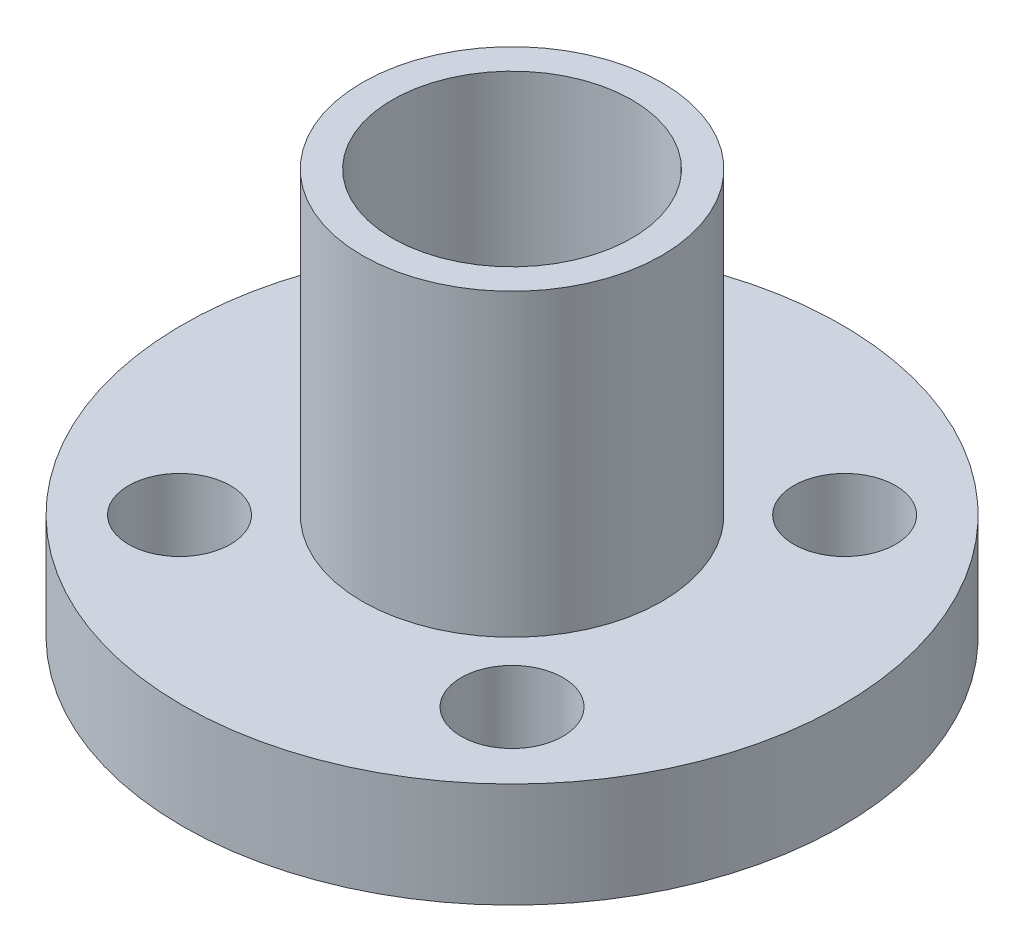
ISO-10303-21;
HEADER;
FILE_DESCRIPTION(('STEP AP214'),'2;1');
FILE_NAME('part.step','',(''),(''),'','','');
FILE_SCHEMA(('AUTOMOTIVE_DESIGN { 1 0 10303 214 1 1 1 1 }'));
ENDSEC;
DATA;
#1=APPLICATION_CONTEXT('core data for automotive mechanical design processes');
#2=APPLICATION_PROTOCOL_DEFINITION('international standard','automotive_design',2000,#1);
#3=PRODUCT_CONTEXT('',#1,'mechanical');
#4=PRODUCT('Part','Part','',(#3));
#5=PRODUCT_RELATED_PRODUCT_CATEGORY('part','',(#4));
#6=PRODUCT_DEFINITION_FORMATION('','',#4);
#7=PRODUCT_DEFINITION_CONTEXT('part definition',#1,'design');
#8=PRODUCT_DEFINITION('design','',#6,#7);
#9=PRODUCT_DEFINITION_SHAPE('','',#8);
#10=(LENGTH_UNIT() NAMED_UNIT(*) SI_UNIT(.MILLI.,.METRE.));
#11=(NAMED_UNIT(*) PLANE_ANGLE_UNIT() SI_UNIT($,.RADIAN.));
#12=(NAMED_UNIT(*) SI_UNIT($,.STERADIAN.) SOLID_ANGLE_UNIT());
#13=UNCERTAINTY_MEASURE_WITH_UNIT(LENGTH_MEASURE(1.E-05),#10,'distance_accuracy_value','');
#14=(GEOMETRIC_REPRESENTATION_CONTEXT(3) GLOBAL_UNCERTAINTY_ASSIGNED_CONTEXT((#13)) GLOBAL_UNIT_ASSIGNED_CONTEXT((#10,
#11,#12)) REPRESENTATION_CONTEXT('',''));
#15=CARTESIAN_POINT('',(0.,0.,0.));
#16=DIRECTION('',(0.,0.,1.));
#17=DIRECTION('',(1.,0.,0.));
#18=AXIS2_PLACEMENT_3D('',#15,#16,#17);
#19=CARTESIAN_POINT('',(-13.8327545983952,3.5,13.4034603001294));
#20=DIRECTION('',(0.,1.,0.));
#21=DIRECTION('',(0.,0.,1.));
#22=AXIS2_PLACEMENT_3D('',#19,#20,#21);
#23=PLANE('',#22);
#24=CARTESIAN_POINT('',(-13.8327545983952,3.5,13.4034603001294));
#25=DIRECTION('',(0.,1.,0.));
#26=DIRECTION('',(0.,0.,1.));
#27=AXIS2_PLACEMENT_3D('',#24,#25,#26);
#28=CIRCLE('',#27,5.);
#29=CARTESIAN_POINT('',(-13.8327545983952,3.5,18.4034603001294));
#30=VERTEX_POINT('',#29);
#31=EDGE_CURVE('E61',#30,#30,#28,.T.);
#32=ORIENTED_EDGE('',*,*,#31,.F.);
#33=EDGE_LOOP('',(#32));
#34=FACE_BOUND('',#33,.T.);
#35=CARTESIAN_POINT('',(-19.3827545983952,3.5,18.9534603001294));
#36=DIRECTION('',(0.,1.,0.));
#37=DIRECTION('',(0.,0.,-1.));
#38=AXIS2_PLACEMENT_3D('',#35,#36,#37);
#39=CIRCLE('',#38,1.70000000000001);
#40=CARTESIAN_POINT('',(-19.3827545983952,3.5,17.2534603001294));
#41=VERTEX_POINT('',#40);
#42=EDGE_CURVE('E79',#41,#41,#39,.T.);
#43=ORIENTED_EDGE('',*,*,#42,.F.);
#44=EDGE_LOOP('',(#43));
#45=FACE_BOUND('',#44,.T.);
#46=CARTESIAN_POINT('',(-8.28275459839524,3.5,7.85346030012943));
#47=DIRECTION('',(0.,1.,0.));
#48=DIRECTION('',(0.,0.,-1.));
#49=AXIS2_PLACEMENT_3D('',#46,#47,#48);
#50=CIRCLE('',#49,1.70000000000001);
#51=CARTESIAN_POINT('',(-8.28275459839524,3.5,6.15346030012942));
#52=VERTEX_POINT('',#51);
#53=EDGE_CURVE('E91',#52,#52,#50,.T.);
#54=ORIENTED_EDGE('',*,*,#53,.F.);
#55=EDGE_LOOP('',(#54));
#56=FACE_BOUND('',#55,.T.);
#57=CARTESIAN_POINT('',(-13.8327545983952,3.5,13.4034603001294));
#58=DIRECTION('',(0.,1.,0.));
#59=DIRECTION('',(0.,0.,1.));
#60=AXIS2_PLACEMENT_3D('',#57,#58,#59);
#61=CIRCLE('',#60,11.);
#62=CARTESIAN_POINT('',(-13.8327545983952,3.5,24.4034603001294));
#63=VERTEX_POINT('',#62);
#64=EDGE_CURVE('E10',#63,#63,#61,.T.);
#65=ORIENTED_EDGE('',*,*,#64,.T.);
#66=EDGE_LOOP('',(#65));
#67=FACE_BOUND('',#66,.T.);
#68=CARTESIAN_POINT('',(-19.3827545983952,3.5,7.85346030012943));
#69=DIRECTION('',(0.,1.,0.));
#70=DIRECTION('',(0.,0.,1.));
#71=AXIS2_PLACEMENT_3D('',#68,#69,#70);
#72=CIRCLE('',#71,1.70000000000001);
#73=CARTESIAN_POINT('',(-19.3827545983952,3.5,9.55346030012944));
#74=VERTEX_POINT('',#73);
#75=EDGE_CURVE('E54',#74,#74,#72,.T.);
#76=ORIENTED_EDGE('',*,*,#75,.F.);
#77=EDGE_LOOP('',(#76));
#78=FACE_BOUND('',#77,.T.);
#79=CARTESIAN_POINT('',(-8.28275459839524,3.5,18.9534603001294));
#80=DIRECTION('',(0.,1.,0.));
#81=DIRECTION('',(0.,0.,1.));
#82=AXIS2_PLACEMENT_3D('',#79,#80,#81);
#83=CIRCLE('',#82,1.70000000000001);
#84=CARTESIAN_POINT('',(-8.28275459839524,3.5,20.6534603001294));
#85=VERTEX_POINT('',#84);
#86=EDGE_CURVE('E85',#85,#85,#83,.T.);
#87=ORIENTED_EDGE('',*,*,#86,.F.);
#88=EDGE_LOOP('',(#87));
#89=FACE_BOUND('',#88,.T.);
#90=ADVANCED_FACE('F41',(#34,#45,#56,#67,#78,#89),#23,.T.);
#91=CARTESIAN_POINT('',(-13.8327545983952,0.,13.4034603001294));
#92=DIRECTION('',(0.,1.,0.));
#93=DIRECTION('',(0.,0.,1.));
#94=AXIS2_PLACEMENT_3D('',#91,#92,#93);
#95=PLANE('',#94);
#96=CARTESIAN_POINT('',(-13.8327545983952,0.,13.4034603001294));
#97=DIRECTION('',(0.,1.,0.));
#98=DIRECTION('',(0.,0.,1.));
#99=AXIS2_PLACEMENT_3D('',#96,#97,#98);
#100=CIRCLE('',#99,5.);
#101=CARTESIAN_POINT('',(-13.8327545983952,0.,18.4034603001294));
#102=VERTEX_POINT('',#101);
#103=EDGE_CURVE('E59',#102,#102,#100,.T.);
#104=ORIENTED_EDGE('',*,*,#103,.T.);
#105=EDGE_LOOP('',(#104));
#106=FACE_BOUND('',#105,.T.);
#107=CARTESIAN_POINT('',(-13.8327545983952,0.,13.4034603001294));
#108=DIRECTION('',(0.,1.,0.));
#109=DIRECTION('',(0.,0.,1.));
#110=AXIS2_PLACEMENT_3D('',#107,#108,#109);
#111=CIRCLE('',#110,11.);
#112=CARTESIAN_POINT('',(-13.8327545983952,0.,24.4034603001294));
#113=VERTEX_POINT('',#112);
#114=EDGE_CURVE('E49',#113,#113,#111,.T.);
#115=ORIENTED_EDGE('',*,*,#114,.F.);
#116=EDGE_LOOP('',(#115));
#117=FACE_BOUND('',#116,.T.);
#118=CARTESIAN_POINT('',(-19.3827545983952,0.,7.85346030012943));
#119=DIRECTION('',(0.,1.,0.));
#120=DIRECTION('',(0.,0.,1.));
#121=AXIS2_PLACEMENT_3D('',#118,#119,#120);
#122=CIRCLE('',#121,1.70000000000001);
#123=CARTESIAN_POINT('',(-19.3827545983952,0.,9.55346030012944));
#124=VERTEX_POINT('',#123);
#125=EDGE_CURVE('E57',#124,#124,#122,.T.);
#126=ORIENTED_EDGE('',*,*,#125,.T.);
#127=EDGE_LOOP('',(#126));
#128=FACE_BOUND('',#127,.T.);
#129=CARTESIAN_POINT('',(-8.28275459839524,0.,7.85346030012943));
#130=DIRECTION('',(0.,1.,0.));
#131=DIRECTION('',(0.,0.,-1.));
#132=AXIS2_PLACEMENT_3D('',#129,#130,#131);
#133=CIRCLE('',#132,1.70000000000001);
#134=CARTESIAN_POINT('',(-8.28275459839524,0.,6.15346030012942));
#135=VERTEX_POINT('',#134);
#136=EDGE_CURVE('E88',#135,#135,#133,.T.);
#137=ORIENTED_EDGE('',*,*,#136,.T.);
#138=EDGE_LOOP('',(#137));
#139=FACE_BOUND('',#138,.T.);
#140=CARTESIAN_POINT('',(-8.28275459839524,0.,18.9534603001294));
#141=DIRECTION('',(0.,1.,0.));
#142=DIRECTION('',(0.,0.,1.));
#143=AXIS2_PLACEMENT_3D('',#140,#141,#142);
#144=CIRCLE('',#143,1.70000000000001);
#145=CARTESIAN_POINT('',(-8.28275459839524,0.,20.6534603001294));
#146=VERTEX_POINT('',#145);
#147=EDGE_CURVE('E82',#146,#146,#144,.T.);
#148=ORIENTED_EDGE('',*,*,#147,.T.);
#149=EDGE_LOOP('',(#148));
#150=FACE_BOUND('',#149,.T.);
#151=CARTESIAN_POINT('',(-19.3827545983952,0.,18.9534603001294));
#152=DIRECTION('',(0.,1.,0.));
#153=DIRECTION('',(0.,0.,-1.));
#154=AXIS2_PLACEMENT_3D('',#151,#152,#153);
#155=CIRCLE('',#154,1.70000000000001);
#156=CARTESIAN_POINT('',(-19.3827545983952,0.,17.2534603001294));
#157=VERTEX_POINT('',#156);
#158=EDGE_CURVE('E77',#157,#157,#155,.T.);
#159=ORIENTED_EDGE('',*,*,#158,.T.);
#160=EDGE_LOOP('',(#159));
#161=FACE_BOUND('',#160,.T.);
#162=ADVANCED_FACE('F101',(#106,#117,#128,#139,#150,#161),#95,.F.);
#163=CARTESIAN_POINT('',(-13.8327545983952,3.5,13.4034603001294));
#164=DIRECTION('',(0.,-1.,0.));
#165=DIRECTION('',(0.,0.,-1.));
#166=AXIS2_PLACEMENT_3D('',#163,#164,#165);
#167=CYLINDRICAL_SURFACE('',#166,11.);
#168=ORIENTED_EDGE('',*,*,#64,.F.);
#169=EDGE_LOOP('',(#168));
#170=FACE_BOUND('',#169,.T.);
#171=ORIENTED_EDGE('',*,*,#114,.T.);
#172=EDGE_LOOP('',(#171));
#173=FACE_BOUND('',#172,.T.);
#174=ADVANCED_FACE('F43',(#170,#173),#167,.T.);
#175=CARTESIAN_POINT('',(-19.3827545983952,3.5,7.85346030012943));
#176=DIRECTION('',(0.,-1.,0.));
#177=DIRECTION('',(0.,0.,-1.));
#178=AXIS2_PLACEMENT_3D('',#175,#176,#177);
#179=CYLINDRICAL_SURFACE('',#178,1.70000000000001);
#180=ORIENTED_EDGE('',*,*,#75,.T.);
#181=EDGE_LOOP('',(#180));
#182=FACE_BOUND('',#181,.T.);
#183=ORIENTED_EDGE('',*,*,#125,.F.);
#184=EDGE_LOOP('',(#183));
#185=FACE_BOUND('',#184,.T.);
#186=ADVANCED_FACE('F104',(#182,#185),#179,.F.);
#187=CARTESIAN_POINT('',(-8.28275459839524,3.5,7.85346030012943));
#188=DIRECTION('',(0.,-1.,0.));
#189=DIRECTION('',(0.,0.,-1.));
#190=AXIS2_PLACEMENT_3D('',#187,#188,#189);
#191=CYLINDRICAL_SURFACE('',#190,1.70000000000001);
#192=ORIENTED_EDGE('',*,*,#53,.T.);
#193=EDGE_LOOP('',(#192));
#194=FACE_BOUND('',#193,.T.);
#195=ORIENTED_EDGE('',*,*,#136,.F.);
#196=EDGE_LOOP('',(#195));
#197=FACE_BOUND('',#196,.T.);
#198=ADVANCED_FACE('F106',(#194,#197),#191,.F.);
#199=CARTESIAN_POINT('',(-8.28275459839524,3.5,18.9534603001294));
#200=DIRECTION('',(0.,-1.,0.));
#201=DIRECTION('',(0.,0.,-1.));
#202=AXIS2_PLACEMENT_3D('',#199,#200,#201);
#203=CYLINDRICAL_SURFACE('',#202,1.70000000000001);
#204=ORIENTED_EDGE('',*,*,#86,.T.);
#205=EDGE_LOOP('',(#204));
#206=FACE_BOUND('',#205,.T.);
#207=ORIENTED_EDGE('',*,*,#147,.F.);
#208=EDGE_LOOP('',(#207));
#209=FACE_BOUND('',#208,.T.);
#210=ADVANCED_FACE('F112',(#206,#209),#203,.F.);
#211=CARTESIAN_POINT('',(-19.3827545983952,3.5,18.9534603001294));
#212=DIRECTION('',(0.,-1.,0.));
#213=DIRECTION('',(0.,0.,-1.));
#214=AXIS2_PLACEMENT_3D('',#211,#212,#213);
#215=CYLINDRICAL_SURFACE('',#214,1.70000000000001);
#216=ORIENTED_EDGE('',*,*,#42,.T.);
#217=EDGE_LOOP('',(#216));
#218=FACE_BOUND('',#217,.T.);
#219=ORIENTED_EDGE('',*,*,#158,.F.);
#220=EDGE_LOOP('',(#219));
#221=FACE_BOUND('',#220,.T.);
#222=ADVANCED_FACE('F133',(#218,#221),#215,.F.);
#223=CARTESIAN_POINT('',(-13.8327545983952,13.5,13.4034603001294));
#224=DIRECTION('',(0.,-1.,0.));
#225=DIRECTION('',(0.,0.,-1.));
#226=AXIS2_PLACEMENT_3D('',#223,#224,#225);
#227=CYLINDRICAL_SURFACE('',#226,5.);
#228=CARTESIAN_POINT('',(-13.8327545983952,13.5,13.4034603001294));
#229=DIRECTION('',(0.,1.,0.));
#230=DIRECTION('',(0.,0.,1.));
#231=AXIS2_PLACEMENT_3D('',#228,#229,#230);
#232=CIRCLE('',#231,5.);
#233=CARTESIAN_POINT('',(-13.8327545983952,13.5,18.4034603001294));
#234=VERTEX_POINT('',#233);
#235=EDGE_CURVE('E66',#234,#234,#232,.T.);
#236=ORIENTED_EDGE('',*,*,#235,.F.);
#237=EDGE_LOOP('',(#236));
#238=FACE_BOUND('',#237,.T.);
#239=ORIENTED_EDGE('',*,*,#31,.T.);
#240=EDGE_LOOP('',(#239));
#241=FACE_BOUND('',#240,.T.);
#242=ADVANCED_FACE('F141',(#238,#241),#227,.T.);
#243=CARTESIAN_POINT('',(-13.8327545983952,13.5,13.4034603001294));
#244=DIRECTION('',(0.,1.,0.));
#245=DIRECTION('',(0.,0.,1.));
#246=AXIS2_PLACEMENT_3D('',#243,#244,#245);
#247=PLANE('',#246);
#248=CARTESIAN_POINT('',(-13.8327545983952,13.5,13.4034603001294));
#249=DIRECTION('',(0.,1.,0.));
#250=DIRECTION('',(0.,0.,1.));
#251=AXIS2_PLACEMENT_3D('',#248,#249,#250);
#252=CIRCLE('',#251,4.);
#253=CARTESIAN_POINT('',(-13.8327545983952,13.5,17.4034603001294));
#254=VERTEX_POINT('',#253);
#255=EDGE_CURVE('E73',#254,#254,#252,.T.);
#256=ORIENTED_EDGE('',*,*,#255,.F.);
#257=EDGE_LOOP('',(#256));
#258=FACE_BOUND('',#257,.T.);
#259=ORIENTED_EDGE('',*,*,#235,.T.);
#260=EDGE_LOOP('',(#259));
#261=FACE_BOUND('',#260,.T.);
#262=ADVANCED_FACE('F147',(#258,#261),#247,.T.);
#263=CARTESIAN_POINT('',(-13.8327545983952,-1.5,13.4034603001294));
#264=DIRECTION('',(0.,1.,0.));
#265=DIRECTION('',(0.,0.,1.));
#266=AXIS2_PLACEMENT_3D('',#263,#264,#265);
#267=CYLINDRICAL_SURFACE('',#266,5.);
#268=CARTESIAN_POINT('',(-13.8327545983952,-1.5,13.4034603001294));
#269=DIRECTION('',(0.,1.,0.));
#270=DIRECTION('',(0.,0.,1.));
#271=AXIS2_PLACEMENT_3D('',#268,#269,#270);
#272=CIRCLE('',#271,5.);
#273=CARTESIAN_POINT('',(-13.8327545983952,-1.5,18.4034603001294));
#274=VERTEX_POINT('',#273);
#275=EDGE_CURVE('E62',#274,#274,#272,.T.);
#276=ORIENTED_EDGE('',*,*,#275,.T.);
#277=EDGE_LOOP('',(#276));
#278=FACE_BOUND('',#277,.T.);
#279=ORIENTED_EDGE('',*,*,#103,.F.);
#280=EDGE_LOOP('',(#279));
#281=FACE_BOUND('',#280,.T.);
#282=ADVANCED_FACE('F153',(#278,#281),#267,.T.);
#283=CARTESIAN_POINT('',(-13.8327545983952,-1.5,13.4034603001294));
#284=DIRECTION('',(0.,1.,0.));
#285=DIRECTION('',(0.,0.,1.));
#286=AXIS2_PLACEMENT_3D('',#283,#284,#285);
#287=PLANE('',#286);
#288=CARTESIAN_POINT('',(-13.8327545983952,-1.5,13.4034603001294));
#289=DIRECTION('',(0.,1.,0.));
#290=DIRECTION('',(0.,0.,1.));
#291=AXIS2_PLACEMENT_3D('',#288,#289,#290);
#292=CIRCLE('',#291,4.);
#293=CARTESIAN_POINT('',(-13.8327545983952,-1.5,17.4034603001294));
#294=VERTEX_POINT('',#293);
#295=EDGE_CURVE('E45',#294,#294,#292,.T.);
#296=ORIENTED_EDGE('',*,*,#295,.T.);
#297=EDGE_LOOP('',(#296));
#298=FACE_BOUND('',#297,.T.);
#299=ORIENTED_EDGE('',*,*,#275,.F.);
#300=EDGE_LOOP('',(#299));
#301=FACE_BOUND('',#300,.T.);
#302=ADVANCED_FACE('F157',(#298,#301),#287,.F.);
#303=CARTESIAN_POINT('',(-13.8327545983952,-6.5,13.4034603001294));
#304=DIRECTION('',(0.,1.,0.));
#305=DIRECTION('',(0.,0.,1.));
#306=AXIS2_PLACEMENT_3D('',#303,#304,#305);
#307=CYLINDRICAL_SURFACE('',#306,4.);
#308=ORIENTED_EDGE('',*,*,#255,.T.);
#309=EDGE_LOOP('',(#308));
#310=FACE_BOUND('',#309,.T.);
#311=ORIENTED_EDGE('',*,*,#295,.F.);
#312=EDGE_LOOP('',(#311));
#313=FACE_BOUND('',#312,.T.);
#314=ADVANCED_FACE('F160',(#310,#313),#307,.F.);
#315=CLOSED_SHELL('',(#90,#162,#174,#186,#198,#210,#222,#242,#262,#282,#302,#314));
#316=MANIFOLD_SOLID_BREP('B2',#315);
#317=ADVANCED_BREP_SHAPE_REPRESENTATION('',(#18,#316),#14);
#318=SHAPE_DEFINITION_REPRESENTATION(#9,#317);
ENDSEC;
END-ISO-10303-21;
